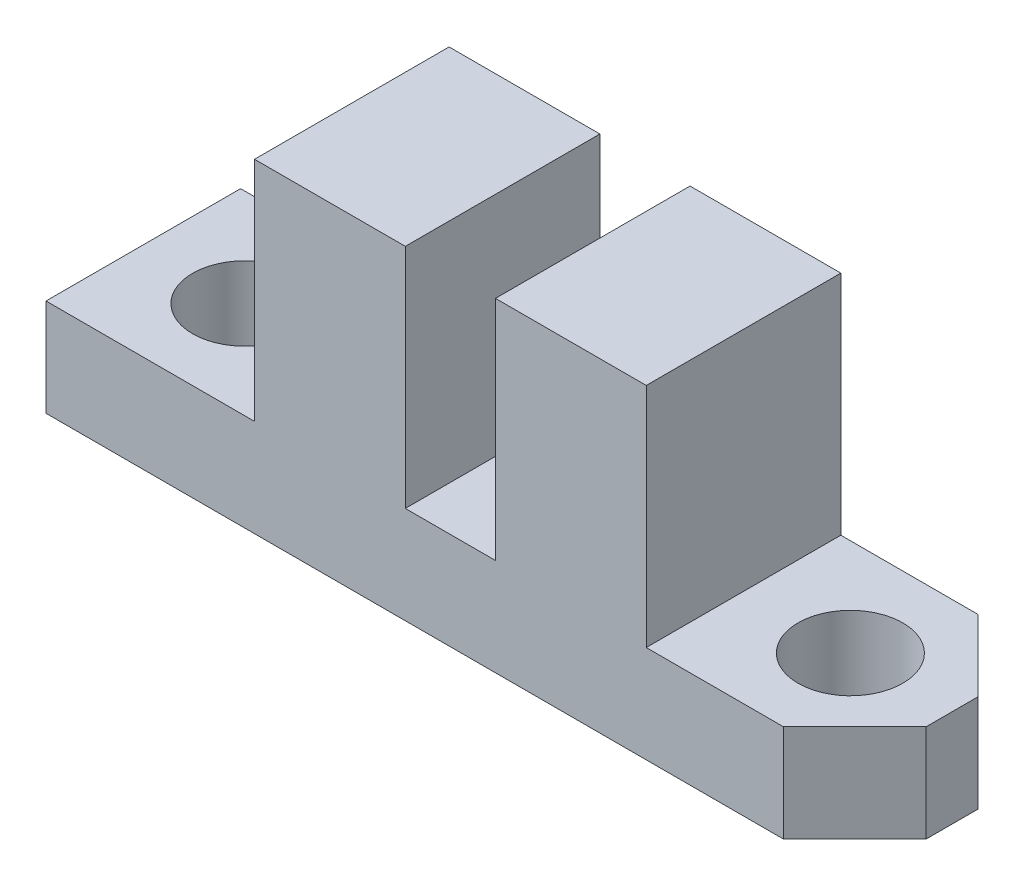
ISO-10303-21;
HEADER;
FILE_DESCRIPTION(('STEP AP214'),'2;1');
FILE_NAME('part.step','',(''),(''),'','','');
FILE_SCHEMA(('AUTOMOTIVE_DESIGN { 1 0 10303 214 1 1 1 1 }'));
ENDSEC;
DATA;
#1=APPLICATION_CONTEXT('core data for automotive mechanical design processes');
#2=APPLICATION_PROTOCOL_DEFINITION('international standard','automotive_design',2000,#1);
#3=PRODUCT_CONTEXT('',#1,'mechanical');
#4=PRODUCT('Part','Part','',(#3));
#5=PRODUCT_RELATED_PRODUCT_CATEGORY('part','',(#4));
#6=PRODUCT_DEFINITION_FORMATION('','',#4);
#7=PRODUCT_DEFINITION_CONTEXT('part definition',#1,'design');
#8=PRODUCT_DEFINITION('design','',#6,#7);
#9=PRODUCT_DEFINITION_SHAPE('','',#8);
#10=(LENGTH_UNIT() NAMED_UNIT(*) SI_UNIT(.MILLI.,.METRE.));
#11=(NAMED_UNIT(*) PLANE_ANGLE_UNIT() SI_UNIT($,.RADIAN.));
#12=(NAMED_UNIT(*) SI_UNIT($,.STERADIAN.) SOLID_ANGLE_UNIT());
#13=UNCERTAINTY_MEASURE_WITH_UNIT(LENGTH_MEASURE(1.E-05),#10,'distance_accuracy_value','');
#14=(GEOMETRIC_REPRESENTATION_CONTEXT(3) GLOBAL_UNCERTAINTY_ASSIGNED_CONTEXT((#13)) GLOBAL_UNIT_ASSIGNED_CONTEXT((#10,
#11,#12)) REPRESENTATION_CONTEXT('',''));
#15=CARTESIAN_POINT('',(0.,0.,0.));
#16=DIRECTION('',(0.,0.,1.));
#17=DIRECTION('',(1.,0.,0.));
#18=AXIS2_PLACEMENT_3D('',#15,#16,#17);
#19=CARTESIAN_POINT('',(0.,3.,0.));
#20=DIRECTION('',(0.,-1.,0.));
#21=DIRECTION('',(0.,0.,-1.));
#22=AXIS2_PLACEMENT_3D('',#19,#20,#21);
#23=PLANE('',#22);
#24=CARTESIAN_POINT('',(9.335,3.,0.));
#25=DIRECTION('',(0.,-1.,0.));
#26=DIRECTION('',(0.,0.,1.));
#27=AXIS2_PLACEMENT_3D('',#24,#25,#26);
#28=CIRCLE('',#27,1.615);
#29=CARTESIAN_POINT('',(9.335,3.,1.615));
#30=VERTEX_POINT('',#29);
#31=EDGE_CURVE('E335',#30,#30,#28,.T.);
#32=ORIENTED_EDGE('',*,*,#31,.T.);
#33=EDGE_LOOP('',(#32));
#34=FACE_BOUND('',#33,.T.);
#35=DIRECTION('',(0.,0.,-1.));
#36=VECTOR('',#35,1.);
#37=CARTESIAN_POINT('',(12.47,3.,3.));
#38=LINE('',#37,#36);
#39=CARTESIAN_POINT('',(12.47,3.,0.799999999999999));
#40=VERTEX_POINT('',#39);
#41=CARTESIAN_POINT('',(12.47,3.,-0.799999999999993));
#42=VERTEX_POINT('',#41);
#43=EDGE_CURVE('E211',#40,#42,#38,.T.);
#44=ORIENTED_EDGE('',*,*,#43,.T.);
#45=DIRECTION('',(0.707106781186546,0.,0.707106781186549));
#46=VECTOR('',#45,1.);
#47=CARTESIAN_POINT('',(10.27,3.,-3.));
#48=LINE('',#47,#46);
#49=CARTESIAN_POINT('',(10.27,3.,-3.));
#50=VERTEX_POINT('',#49);
#51=EDGE_CURVE('E41',#42,#50,#48,.F.);
#52=ORIENTED_EDGE('',*,*,#51,.T.);
#53=DIRECTION('',(-1.,0.,0.));
#54=VECTOR('',#53,1.);
#55=CARTESIAN_POINT('',(-12.47,3.,-3.));
#56=LINE('',#55,#54);
#57=CARTESIAN_POINT('',(6.04,3.,-3.));
#58=VERTEX_POINT('',#57);
#59=EDGE_CURVE('E215',#50,#58,#56,.T.);
#60=ORIENTED_EDGE('',*,*,#59,.T.);
#61=DIRECTION('',(0.,0.,1.));
#62=VECTOR('',#61,1.);
#63=CARTESIAN_POINT('',(6.04,3.,-3.));
#64=LINE('',#63,#62);
#65=CARTESIAN_POINT('',(6.04,3.,3.));
#66=VERTEX_POINT('',#65);
#67=EDGE_CURVE('E143',#58,#66,#64,.T.);
#68=ORIENTED_EDGE('',*,*,#67,.T.);
#69=DIRECTION('',(1.,0.,0.));
#70=VECTOR('',#69,1.);
#71=CARTESIAN_POINT('',(-12.47,3.,3.));
#72=LINE('',#71,#70);
#73=CARTESIAN_POINT('',(10.27,3.,3.));
#74=VERTEX_POINT('',#73);
#75=EDGE_CURVE('E220',#66,#74,#72,.T.);
#76=ORIENTED_EDGE('',*,*,#75,.T.);
#77=DIRECTION('',(-0.707106781186549,0.,0.707106781186546));
#78=VECTOR('',#77,1.);
#79=CARTESIAN_POINT('',(12.47,3.,0.799999999999999));
#80=LINE('',#79,#78);
#81=EDGE_CURVE('E247',#74,#40,#80,.F.);
#82=ORIENTED_EDGE('',*,*,#81,.T.);
#83=EDGE_LOOP('',(#44,#52,#60,#68,#76,#82));
#84=FACE_BOUND('',#83,.T.);
#85=ADVANCED_FACE('F33',(#34,#84),#23,.F.);
#86=CARTESIAN_POINT('',(-9.335,3.,0.));
#87=DIRECTION('',(0.,1.,0.));
#88=DIRECTION('',(0.,0.,1.));
#89=AXIS2_PLACEMENT_3D('',#86,#87,#88);
#90=CIRCLE('',#89,1.615);
#91=CARTESIAN_POINT('',(-9.335,3.,1.615));
#92=VERTEX_POINT('',#91);
#93=EDGE_CURVE('E147',#92,#92,#90,.T.);
#94=ORIENTED_EDGE('',*,*,#93,.F.);
#95=EDGE_LOOP('',(#94));
#96=FACE_BOUND('',#95,.T.);
#97=DIRECTION('',(0.,0.,1.));
#98=VECTOR('',#97,1.);
#99=CARTESIAN_POINT('',(-6.04,3.,-3.));
#100=LINE('',#99,#98);
#101=CARTESIAN_POINT('',(-6.04,3.,-3.));
#102=VERTEX_POINT('',#101);
#103=CARTESIAN_POINT('',(-6.04,3.,3.));
#104=VERTEX_POINT('',#103);
#105=EDGE_CURVE('E181',#102,#104,#100,.T.);
#106=ORIENTED_EDGE('',*,*,#105,.F.);
#107=CARTESIAN_POINT('',(-12.47,3.,-3.));
#108=VERTEX_POINT('',#107);
#109=EDGE_CURVE('E213',#102,#108,#56,.T.);
#110=ORIENTED_EDGE('',*,*,#109,.T.);
#111=DIRECTION('',(0.,0.,1.));
#112=VECTOR('',#111,1.);
#113=CARTESIAN_POINT('',(-12.47,3.,3.));
#114=LINE('',#113,#112);
#115=CARTESIAN_POINT('',(-12.47,3.,3.));
#116=VERTEX_POINT('',#115);
#117=EDGE_CURVE('E217',#108,#116,#114,.T.);
#118=ORIENTED_EDGE('',*,*,#117,.T.);
#119=EDGE_CURVE('E221',#116,#104,#72,.T.);
#120=ORIENTED_EDGE('',*,*,#119,.T.);
#121=EDGE_LOOP('',(#106,#110,#118,#120));
#122=FACE_BOUND('',#121,.T.);
#123=ADVANCED_FACE('F302',(#96,#122),#23,.F.);
#124=CARTESIAN_POINT('',(-1.39,3.,3.));
#125=VERTEX_POINT('',#124);
#126=CARTESIAN_POINT('',(1.39,3.,3.));
#127=VERTEX_POINT('',#126);
#128=EDGE_CURVE('E224',#125,#127,#72,.T.);
#129=ORIENTED_EDGE('',*,*,#128,.T.);
#130=DIRECTION('',(0.,0.,-1.));
#131=VECTOR('',#130,1.);
#132=CARTESIAN_POINT('',(1.39,3.,-3.));
#133=LINE('',#132,#131);
#134=CARTESIAN_POINT('',(1.39,3.,-3.));
#135=VERTEX_POINT('',#134);
#136=EDGE_CURVE('E158',#127,#135,#133,.T.);
#137=ORIENTED_EDGE('',*,*,#136,.T.);
#138=CARTESIAN_POINT('',(-1.39,3.,-3.));
#139=VERTEX_POINT('',#138);
#140=EDGE_CURVE('E218',#135,#139,#56,.T.);
#141=ORIENTED_EDGE('',*,*,#140,.T.);
#142=DIRECTION('',(0.,0.,-1.));
#143=VECTOR('',#142,1.);
#144=CARTESIAN_POINT('',(-1.39,3.,-3.));
#145=LINE('',#144,#143);
#146=EDGE_CURVE('E188',#125,#139,#145,.T.);
#147=ORIENTED_EDGE('',*,*,#146,.F.);
#148=EDGE_LOOP('',(#129,#137,#141,#147));
#149=FACE_BOUND('',#148,.T.);
#150=ADVANCED_FACE('F287',(#149),#23,.F.);
#151=CARTESIAN_POINT('',(12.47,3.,3.));
#152=DIRECTION('',(-1.,0.,0.));
#153=DIRECTION('',(0.,0.,1.));
#154=AXIS2_PLACEMENT_3D('',#151,#152,#153);
#155=PLANE('',#154);
#156=DIRECTION('',(0.,0.,-1.));
#157=VECTOR('',#156,1.);
#158=CARTESIAN_POINT('',(12.47,0.,3.));
#159=LINE('',#158,#157);
#160=CARTESIAN_POINT('',(12.47,0.,0.799999999999999));
#161=VERTEX_POINT('',#160);
#162=CARTESIAN_POINT('',(12.47,0.,-0.799999999999993));
#163=VERTEX_POINT('',#162);
#164=EDGE_CURVE('E210',#161,#163,#159,.T.);
#165=ORIENTED_EDGE('',*,*,#164,.T.);
#166=DIRECTION('',(0.,1.,0.));
#167=VECTOR('',#166,1.);
#168=CARTESIAN_POINT('',(12.47,3.,-0.799999999999993));
#169=LINE('',#168,#167);
#170=EDGE_CURVE('E54',#163,#42,#169,.T.);
#171=ORIENTED_EDGE('',*,*,#170,.T.);
#172=ORIENTED_EDGE('',*,*,#43,.F.);
#173=DIRECTION('',(0.,-1.,0.));
#174=VECTOR('',#173,1.);
#175=CARTESIAN_POINT('',(12.47,3.,0.799999999999999));
#176=LINE('',#175,#174);
#177=EDGE_CURVE('E243',#40,#161,#176,.T.);
#178=ORIENTED_EDGE('',*,*,#177,.T.);
#179=EDGE_LOOP('',(#165,#171,#172,#178));
#180=FACE_BOUND('',#179,.T.);
#181=ADVANCED_FACE('F258',(#180),#155,.F.);
#182=CARTESIAN_POINT('',(-12.47,3.,-3.));
#183=DIRECTION('',(0.,0.,1.));
#184=DIRECTION('',(1.,0.,0.));
#185=AXIS2_PLACEMENT_3D('',#182,#183,#184);
#186=PLANE('',#185);
#187=ORIENTED_EDGE('',*,*,#59,.F.);
#188=DIRECTION('',(0.,-1.,0.));
#189=VECTOR('',#188,1.);
#190=CARTESIAN_POINT('',(10.27,3.,-3.));
#191=LINE('',#190,#189);
#192=CARTESIAN_POINT('',(10.27,0.,-3.));
#193=VERTEX_POINT('',#192);
#194=EDGE_CURVE('E236',#50,#193,#191,.T.);
#195=ORIENTED_EDGE('',*,*,#194,.T.);
#196=DIRECTION('',(-1.,0.,0.));
#197=VECTOR('',#196,1.);
#198=CARTESIAN_POINT('',(-12.47,0.,-3.));
#199=LINE('',#198,#197);
#200=CARTESIAN_POINT('',(-12.47,0.,-3.));
#201=VERTEX_POINT('',#200);
#202=EDGE_CURVE('E226',#193,#201,#199,.T.);
#203=ORIENTED_EDGE('',*,*,#202,.T.);
#204=DIRECTION('',(0.,-1.,0.));
#205=VECTOR('',#204,1.);
#206=CARTESIAN_POINT('',(-12.47,3.,-3.));
#207=LINE('',#206,#205);
#208=EDGE_CURVE('E233',#108,#201,#207,.T.);
#209=ORIENTED_EDGE('',*,*,#208,.F.);
#210=ORIENTED_EDGE('',*,*,#109,.F.);
#211=DIRECTION('',(0.,-1.,0.));
#212=VECTOR('',#211,1.);
#213=CARTESIAN_POINT('',(-6.04,10.,-3.));
#214=LINE('',#213,#212);
#215=CARTESIAN_POINT('',(-6.04,10.,-3.));
#216=VERTEX_POINT('',#215);
#217=EDGE_CURVE('E194',#216,#102,#214,.T.);
#218=ORIENTED_EDGE('',*,*,#217,.F.);
#219=DIRECTION('',(-1.,0.,0.));
#220=VECTOR('',#219,1.);
#221=CARTESIAN_POINT('',(-6.04,10.,-3.));
#222=LINE('',#221,#220);
#223=CARTESIAN_POINT('',(-1.39,10.,-3.));
#224=VERTEX_POINT('',#223);
#225=EDGE_CURVE('E192',#224,#216,#222,.T.);
#226=ORIENTED_EDGE('',*,*,#225,.F.);
#227=DIRECTION('',(0.,-1.,0.));
#228=VECTOR('',#227,1.);
#229=CARTESIAN_POINT('',(-1.39,10.,-3.));
#230=LINE('',#229,#228);
#231=EDGE_CURVE('E201',#224,#139,#230,.T.);
#232=ORIENTED_EDGE('',*,*,#231,.T.);
#233=ORIENTED_EDGE('',*,*,#140,.F.);
#234=DIRECTION('',(0.,-1.,0.));
#235=VECTOR('',#234,1.);
#236=CARTESIAN_POINT('',(1.39,10.,-3.));
#237=LINE('',#236,#235);
#238=CARTESIAN_POINT('',(1.39,10.,-3.));
#239=VERTEX_POINT('',#238);
#240=EDGE_CURVE('E148',#239,#135,#237,.T.);
#241=ORIENTED_EDGE('',*,*,#240,.F.);
#242=DIRECTION('',(1.,0.,0.));
#243=VECTOR('',#242,1.);
#244=CARTESIAN_POINT('',(6.04,10.,-3.));
#245=LINE('',#244,#243);
#246=CARTESIAN_POINT('',(6.04,10.,-3.));
#247=VERTEX_POINT('',#246);
#248=EDGE_CURVE('E154',#239,#247,#245,.T.);
#249=ORIENTED_EDGE('',*,*,#248,.T.);
#250=DIRECTION('',(0.,-1.,0.));
#251=VECTOR('',#250,1.);
#252=CARTESIAN_POINT('',(6.04,10.,-3.));
#253=LINE('',#252,#251);
#254=EDGE_CURVE('E136',#247,#58,#253,.T.);
#255=ORIENTED_EDGE('',*,*,#254,.T.);
#256=EDGE_LOOP('',(#187,#195,#203,#209,#210,#218,#226,#232,#233,#241,#249,#255));
#257=FACE_BOUND('',#256,.T.);
#258=ADVANCED_FACE('F160',(#257),#186,.F.);
#259=CARTESIAN_POINT('',(-12.47,3.,3.));
#260=DIRECTION('',(1.,0.,0.));
#261=DIRECTION('',(0.,0.,-1.));
#262=AXIS2_PLACEMENT_3D('',#259,#260,#261);
#263=PLANE('',#262);
#264=DIRECTION('',(0.,0.,1.));
#265=VECTOR('',#264,1.);
#266=CARTESIAN_POINT('',(-12.47,0.,3.));
#267=LINE('',#266,#265);
#268=CARTESIAN_POINT('',(-12.47,0.,3.));
#269=VERTEX_POINT('',#268);
#270=EDGE_CURVE('E228',#201,#269,#267,.T.);
#271=ORIENTED_EDGE('',*,*,#270,.T.);
#272=DIRECTION('',(0.,-1.,0.));
#273=VECTOR('',#272,1.);
#274=CARTESIAN_POINT('',(-12.47,3.,3.));
#275=LINE('',#274,#273);
#276=EDGE_CURVE('E223',#116,#269,#275,.T.);
#277=ORIENTED_EDGE('',*,*,#276,.F.);
#278=ORIENTED_EDGE('',*,*,#117,.F.);
#279=ORIENTED_EDGE('',*,*,#208,.T.);
#280=EDGE_LOOP('',(#271,#277,#278,#279));
#281=FACE_BOUND('',#280,.T.);
#282=ADVANCED_FACE('F268',(#281),#263,.F.);
#283=CARTESIAN_POINT('',(-12.47,3.,3.));
#284=DIRECTION('',(0.,0.,-1.));
#285=DIRECTION('',(-1.,0.,0.));
#286=AXIS2_PLACEMENT_3D('',#283,#284,#285);
#287=PLANE('',#286);
#288=DIRECTION('',(1.,0.,0.));
#289=VECTOR('',#288,1.);
#290=CARTESIAN_POINT('',(-12.47,0.,3.));
#291=LINE('',#290,#289);
#292=CARTESIAN_POINT('',(10.27,0.,3.));
#293=VERTEX_POINT('',#292);
#294=EDGE_CURVE('E214',#269,#293,#291,.T.);
#295=ORIENTED_EDGE('',*,*,#294,.T.);
#296=DIRECTION('',(0.,1.,0.));
#297=VECTOR('',#296,1.);
#298=CARTESIAN_POINT('',(10.27,3.,3.));
#299=LINE('',#298,#297);
#300=EDGE_CURVE('E11',#293,#74,#299,.T.);
#301=ORIENTED_EDGE('',*,*,#300,.T.);
#302=ORIENTED_EDGE('',*,*,#75,.F.);
#303=DIRECTION('',(0.,-1.,0.));
#304=VECTOR('',#303,1.);
#305=CARTESIAN_POINT('',(6.04,10.,3.));
#306=LINE('',#305,#304);
#307=CARTESIAN_POINT('',(6.04,10.,3.));
#308=VERTEX_POINT('',#307);
#309=EDGE_CURVE('E169',#308,#66,#306,.T.);
#310=ORIENTED_EDGE('',*,*,#309,.F.);
#311=DIRECTION('',(-1.,0.,0.));
#312=VECTOR('',#311,1.);
#313=CARTESIAN_POINT('',(6.04,10.,3.));
#314=LINE('',#313,#312);
#315=CARTESIAN_POINT('',(1.39,10.,3.));
#316=VERTEX_POINT('',#315);
#317=EDGE_CURVE('E157',#308,#316,#314,.T.);
#318=ORIENTED_EDGE('',*,*,#317,.T.);
#319=DIRECTION('',(0.,-1.,0.));
#320=VECTOR('',#319,1.);
#321=CARTESIAN_POINT('',(1.39,10.,3.));
#322=LINE('',#321,#320);
#323=EDGE_CURVE('E174',#316,#127,#322,.T.);
#324=ORIENTED_EDGE('',*,*,#323,.T.);
#325=ORIENTED_EDGE('',*,*,#128,.F.);
#326=DIRECTION('',(0.,-1.,0.));
#327=VECTOR('',#326,1.);
#328=CARTESIAN_POINT('',(-1.39,10.,3.));
#329=LINE('',#328,#327);
#330=CARTESIAN_POINT('',(-1.39,10.,3.));
#331=VERTEX_POINT('',#330);
#332=EDGE_CURVE('E204',#331,#125,#329,.T.);
#333=ORIENTED_EDGE('',*,*,#332,.F.);
#334=DIRECTION('',(1.,0.,0.));
#335=VECTOR('',#334,1.);
#336=CARTESIAN_POINT('',(-6.04,10.,3.));
#337=LINE('',#336,#335);
#338=CARTESIAN_POINT('',(-6.04,10.,3.));
#339=VERTEX_POINT('',#338);
#340=EDGE_CURVE('E187',#339,#331,#337,.T.);
#341=ORIENTED_EDGE('',*,*,#340,.F.);
#342=DIRECTION('',(0.,-1.,0.));
#343=VECTOR('',#342,1.);
#344=CARTESIAN_POINT('',(-6.04,10.,3.));
#345=LINE('',#344,#343);
#346=EDGE_CURVE('E207',#339,#104,#345,.T.);
#347=ORIENTED_EDGE('',*,*,#346,.T.);
#348=ORIENTED_EDGE('',*,*,#119,.F.);
#349=ORIENTED_EDGE('',*,*,#276,.T.);
#350=EDGE_LOOP('',(#295,#301,#302,#310,#318,#324,#325,#333,#341,#347,#348,#349));
#351=FACE_BOUND('',#350,.T.);
#352=ADVANCED_FACE('F263',(#351),#287,.F.);
#353=CARTESIAN_POINT('',(0.,0.,0.));
#354=DIRECTION('',(0.,-1.,0.));
#355=DIRECTION('',(0.,0.,-1.));
#356=AXIS2_PLACEMENT_3D('',#353,#354,#355);
#357=PLANE('',#356);
#358=CARTESIAN_POINT('',(9.335,0.,0.));
#359=DIRECTION('',(0.,-1.,0.));
#360=DIRECTION('',(0.,0.,1.));
#361=AXIS2_PLACEMENT_3D('',#358,#359,#360);
#362=CIRCLE('',#361,1.615);
#363=CARTESIAN_POINT('',(9.335,0.,1.615));
#364=VERTEX_POINT('',#363);
#365=EDGE_CURVE('E171',#364,#364,#362,.T.);
#366=ORIENTED_EDGE('',*,*,#365,.F.);
#367=EDGE_LOOP('',(#366));
#368=FACE_BOUND('',#367,.T.);
#369=CARTESIAN_POINT('',(-9.335,0.,0.));
#370=DIRECTION('',(0.,1.,0.));
#371=DIRECTION('',(0.,0.,1.));
#372=AXIS2_PLACEMENT_3D('',#369,#370,#371);
#373=CIRCLE('',#372,1.615);
#374=CARTESIAN_POINT('',(-9.335,0.,1.615));
#375=VERTEX_POINT('',#374);
#376=EDGE_CURVE('E178',#375,#375,#373,.T.);
#377=ORIENTED_EDGE('',*,*,#376,.T.);
#378=EDGE_LOOP('',(#377));
#379=FACE_BOUND('',#378,.T.);
#380=ORIENTED_EDGE('',*,*,#202,.F.);
#381=DIRECTION('',(-0.707106781186546,0.,-0.707106781186549));
#382=VECTOR('',#381,1.);
#383=CARTESIAN_POINT('',(6.63500000000002,0.,-6.635));
#384=LINE('',#383,#382);
#385=EDGE_CURVE('E241',#193,#163,#384,.F.);
#386=ORIENTED_EDGE('',*,*,#385,.T.);
#387=ORIENTED_EDGE('',*,*,#164,.F.);
#388=DIRECTION('',(0.707106781186549,0.,-0.707106781186546));
#389=VECTOR('',#388,1.);
#390=CARTESIAN_POINT('',(6.63499999999998,0.,6.635));
#391=LINE('',#390,#389);
#392=EDGE_CURVE('E239',#161,#293,#391,.F.);
#393=ORIENTED_EDGE('',*,*,#392,.T.);
#394=ORIENTED_EDGE('',*,*,#294,.F.);
#395=ORIENTED_EDGE('',*,*,#270,.F.);
#396=EDGE_LOOP('',(#380,#386,#387,#393,#394,#395));
#397=FACE_BOUND('',#396,.T.);
#398=ADVANCED_FACE('F256',(#368,#379,#397),#357,.T.);
#399=CARTESIAN_POINT('',(-6.04,10.,-3.));
#400=DIRECTION('',(1.,0.,0.));
#401=DIRECTION('',(0.,0.,-1.));
#402=AXIS2_PLACEMENT_3D('',#399,#400,#401);
#403=PLANE('',#402);
#404=ORIENTED_EDGE('',*,*,#105,.T.);
#405=ORIENTED_EDGE('',*,*,#346,.F.);
#406=DIRECTION('',(0.,0.,1.));
#407=VECTOR('',#406,1.);
#408=CARTESIAN_POINT('',(-6.04,10.,-3.));
#409=LINE('',#408,#407);
#410=EDGE_CURVE('E184',#216,#339,#409,.T.);
#411=ORIENTED_EDGE('',*,*,#410,.F.);
#412=ORIENTED_EDGE('',*,*,#217,.T.);
#413=EDGE_LOOP('',(#404,#405,#411,#412));
#414=FACE_BOUND('',#413,.T.);
#415=ADVANCED_FACE('F276',(#414),#403,.F.);
#416=CARTESIAN_POINT('',(-1.39,10.,-3.));
#417=DIRECTION('',(-1.,0.,0.));
#418=DIRECTION('',(0.,0.,1.));
#419=AXIS2_PLACEMENT_3D('',#416,#417,#418);
#420=PLANE('',#419);
#421=ORIENTED_EDGE('',*,*,#146,.T.);
#422=ORIENTED_EDGE('',*,*,#231,.F.);
#423=DIRECTION('',(0.,0.,-1.));
#424=VECTOR('',#423,1.);
#425=CARTESIAN_POINT('',(-1.39,10.,-3.));
#426=LINE('',#425,#424);
#427=EDGE_CURVE('E190',#331,#224,#426,.T.);
#428=ORIENTED_EDGE('',*,*,#427,.F.);
#429=ORIENTED_EDGE('',*,*,#332,.T.);
#430=EDGE_LOOP('',(#421,#422,#428,#429));
#431=FACE_BOUND('',#430,.T.);
#432=ADVANCED_FACE('F284',(#431),#420,.F.);
#433=CARTESIAN_POINT('',(0.,10.,0.));
#434=DIRECTION('',(0.,1.,0.));
#435=DIRECTION('',(0.,0.,1.));
#436=AXIS2_PLACEMENT_3D('',#433,#434,#435);
#437=PLANE('',#436);
#438=ORIENTED_EDGE('',*,*,#410,.T.);
#439=ORIENTED_EDGE('',*,*,#340,.T.);
#440=ORIENTED_EDGE('',*,*,#427,.T.);
#441=ORIENTED_EDGE('',*,*,#225,.T.);
#442=EDGE_LOOP('',(#438,#439,#440,#441));
#443=FACE_BOUND('',#442,.T.);
#444=ADVANCED_FACE('F279',(#443),#437,.T.);
#445=CARTESIAN_POINT('',(-9.335,0.,0.));
#446=DIRECTION('',(0.,1.,0.));
#447=DIRECTION('',(0.,0.,1.));
#448=AXIS2_PLACEMENT_3D('',#445,#446,#447);
#449=CYLINDRICAL_SURFACE('',#448,1.615);
#450=ORIENTED_EDGE('',*,*,#376,.F.);
#451=EDGE_LOOP('',(#450));
#452=FACE_BOUND('',#451,.T.);
#453=ORIENTED_EDGE('',*,*,#93,.T.);
#454=EDGE_LOOP('',(#453));
#455=FACE_BOUND('',#454,.T.);
#456=ADVANCED_FACE('F299',(#452,#455),#449,.F.);
#457=CARTESIAN_POINT('',(6.04,10.,-3.));
#458=DIRECTION('',(1.,0.,0.));
#459=DIRECTION('',(0.,0.,-1.));
#460=AXIS2_PLACEMENT_3D('',#457,#458,#459);
#461=PLANE('',#460);
#462=ORIENTED_EDGE('',*,*,#67,.F.);
#463=ORIENTED_EDGE('',*,*,#254,.F.);
#464=DIRECTION('',(0.,0.,1.));
#465=VECTOR('',#464,1.);
#466=CARTESIAN_POINT('',(6.04,10.,-3.));
#467=LINE('',#466,#465);
#468=EDGE_CURVE('E140',#247,#308,#467,.T.);
#469=ORIENTED_EDGE('',*,*,#468,.T.);
#470=ORIENTED_EDGE('',*,*,#309,.T.);
#471=EDGE_LOOP('',(#462,#463,#469,#470));
#472=FACE_BOUND('',#471,.T.);
#473=ADVANCED_FACE('F138',(#472),#461,.T.);
#474=CARTESIAN_POINT('',(1.39,10.,-3.));
#475=DIRECTION('',(-1.,0.,0.));
#476=DIRECTION('',(0.,0.,1.));
#477=AXIS2_PLACEMENT_3D('',#474,#475,#476);
#478=PLANE('',#477);
#479=ORIENTED_EDGE('',*,*,#136,.F.);
#480=ORIENTED_EDGE('',*,*,#323,.F.);
#481=DIRECTION('',(0.,0.,-1.));
#482=VECTOR('',#481,1.);
#483=CARTESIAN_POINT('',(1.39,10.,-3.));
#484=LINE('',#483,#482);
#485=EDGE_CURVE('E163',#316,#239,#484,.T.);
#486=ORIENTED_EDGE('',*,*,#485,.T.);
#487=ORIENTED_EDGE('',*,*,#240,.T.);
#488=EDGE_LOOP('',(#479,#480,#486,#487));
#489=FACE_BOUND('',#488,.T.);
#490=ADVANCED_FACE('F290',(#489),#478,.T.);
#491=CARTESIAN_POINT('',(0.,10.,0.));
#492=DIRECTION('',(0.,1.,0.));
#493=DIRECTION('',(0.,0.,1.));
#494=AXIS2_PLACEMENT_3D('',#491,#492,#493);
#495=PLANE('',#494);
#496=ORIENTED_EDGE('',*,*,#468,.F.);
#497=ORIENTED_EDGE('',*,*,#248,.F.);
#498=ORIENTED_EDGE('',*,*,#485,.F.);
#499=ORIENTED_EDGE('',*,*,#317,.F.);
#500=EDGE_LOOP('',(#496,#497,#498,#499));
#501=FACE_BOUND('',#500,.T.);
#502=ADVANCED_FACE('F152',(#501),#495,.T.);
#503=CARTESIAN_POINT('',(9.335,0.,0.));
#504=DIRECTION('',(0.,1.,0.));
#505=DIRECTION('',(0.,0.,1.));
#506=AXIS2_PLACEMENT_3D('',#503,#504,#505);
#507=CYLINDRICAL_SURFACE('',#506,1.615);
#508=ORIENTED_EDGE('',*,*,#365,.T.);
#509=EDGE_LOOP('',(#508));
#510=FACE_BOUND('',#509,.T.);
#511=ORIENTED_EDGE('',*,*,#31,.F.);
#512=EDGE_LOOP('',(#511));
#513=FACE_BOUND('',#512,.T.);
#514=ADVANCED_FACE('F297',(#510,#513),#507,.F.);
#515=CARTESIAN_POINT('',(10.27,3.,-3.));
#516=DIRECTION('',(-0.707106781186549,0.,0.707106781186546));
#517=DIRECTION('',(0.,-1.,0.));
#518=AXIS2_PLACEMENT_3D('',#515,#516,#517);
#519=PLANE('',#518);
#520=ORIENTED_EDGE('',*,*,#51,.F.);
#521=ORIENTED_EDGE('',*,*,#170,.F.);
#522=ORIENTED_EDGE('',*,*,#385,.F.);
#523=ORIENTED_EDGE('',*,*,#194,.F.);
#524=EDGE_LOOP('',(#520,#521,#522,#523));
#525=FACE_BOUND('',#524,.T.);
#526=ADVANCED_FACE('F253',(#525),#519,.F.);
#527=CARTESIAN_POINT('',(12.47,3.,0.799999999999999));
#528=DIRECTION('',(-0.707106781186546,0.,-0.707106781186549));
#529=DIRECTION('',(0.,-1.,0.));
#530=AXIS2_PLACEMENT_3D('',#527,#528,#529);
#531=PLANE('',#530);
#532=ORIENTED_EDGE('',*,*,#81,.F.);
#533=ORIENTED_EDGE('',*,*,#300,.F.);
#534=ORIENTED_EDGE('',*,*,#392,.F.);
#535=ORIENTED_EDGE('',*,*,#177,.F.);
#536=EDGE_LOOP('',(#532,#533,#534,#535));
#537=FACE_BOUND('',#536,.T.);
#538=ADVANCED_FACE('F35',(#537),#531,.F.);
#539=CLOSED_SHELL('',(#85,#123,#150,#181,#258,#282,#352,#398,#415,#432,#444,#456,#473,#490,#502,
#514,#526,#538));
#540=MANIFOLD_SOLID_BREP('B2',#539);
#541=ADVANCED_BREP_SHAPE_REPRESENTATION('',(#18,#540),#14);
#542=SHAPE_DEFINITION_REPRESENTATION(#9,#541);
ENDSEC;
END-ISO-10303-21;
